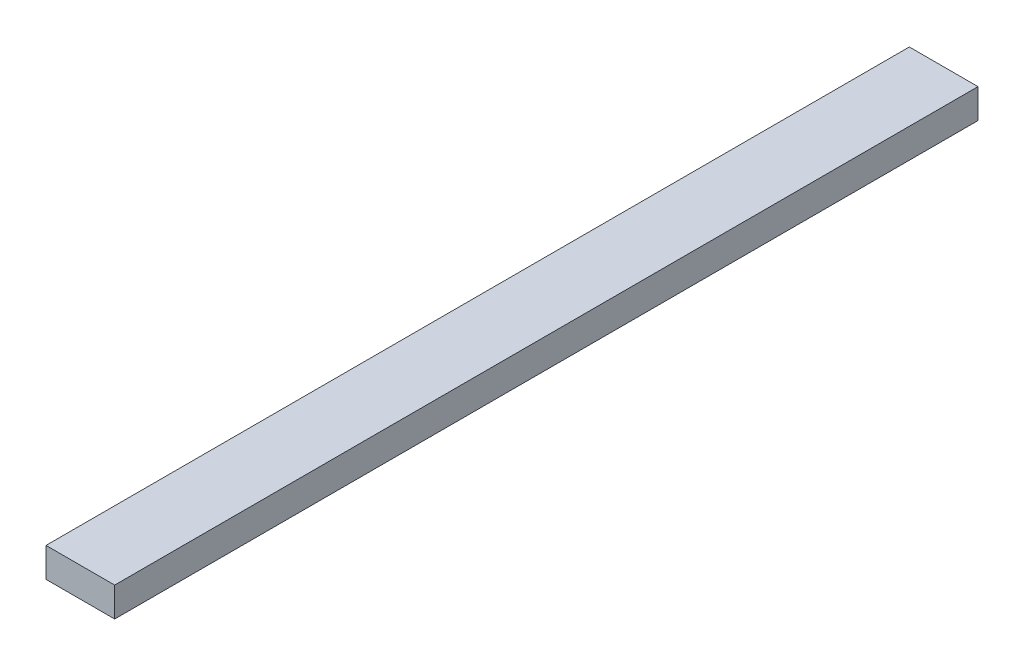
ISO-10303-21;
HEADER;
FILE_DESCRIPTION(('STEP AP214'),'2;1');
FILE_NAME('part.step','',(''),(''),'','','');
FILE_SCHEMA(('AUTOMOTIVE_DESIGN { 1 0 10303 214 1 1 1 1 }'));
ENDSEC;
DATA;
#1=APPLICATION_CONTEXT('core data for automotive mechanical design processes');
#2=APPLICATION_PROTOCOL_DEFINITION('international standard','automotive_design',2000,#1);
#3=PRODUCT_CONTEXT('',#1,'mechanical');
#4=PRODUCT('Part','Part','',(#3));
#5=PRODUCT_RELATED_PRODUCT_CATEGORY('part','',(#4));
#6=PRODUCT_DEFINITION_FORMATION('','',#4);
#7=PRODUCT_DEFINITION_CONTEXT('part definition',#1,'design');
#8=PRODUCT_DEFINITION('design','',#6,#7);
#9=PRODUCT_DEFINITION_SHAPE('','',#8);
#10=(LENGTH_UNIT() NAMED_UNIT(*) SI_UNIT(.MILLI.,.METRE.));
#11=(NAMED_UNIT(*) PLANE_ANGLE_UNIT() SI_UNIT($,.RADIAN.));
#12=(NAMED_UNIT(*) SI_UNIT($,.STERADIAN.) SOLID_ANGLE_UNIT());
#13=UNCERTAINTY_MEASURE_WITH_UNIT(LENGTH_MEASURE(1.E-05),#10,'distance_accuracy_value','');
#14=(GEOMETRIC_REPRESENTATION_CONTEXT(3) GLOBAL_UNCERTAINTY_ASSIGNED_CONTEXT((#13)) GLOBAL_UNIT_ASSIGNED_CONTEXT((#10,
#11,#12)) REPRESENTATION_CONTEXT('',''));
#15=CARTESIAN_POINT('',(0.,0.,0.));
#16=DIRECTION('',(0.,0.,1.));
#17=DIRECTION('',(1.,0.,0.));
#18=AXIS2_PLACEMENT_3D('',#15,#16,#17);
#19=CARTESIAN_POINT('',(0.,0.,1117.6));
#20=DIRECTION('',(1.,0.,0.));
#21=DIRECTION('',(0.,0.,-1.));
#22=AXIS2_PLACEMENT_3D('',#19,#20,#21);
#23=PLANE('',#22);
#24=DIRECTION('',(0.,-1.,0.));
#25=VECTOR('',#24,1.);
#26=CARTESIAN_POINT('',(0.,0.,0.));
#27=LINE('',#26,#25);
#28=CARTESIAN_POINT('',(0.,38.1,0.));
#29=VERTEX_POINT('',#28);
#30=CARTESIAN_POINT('',(0.,0.,0.));
#31=VERTEX_POINT('',#30);
#32=EDGE_CURVE('E96',#29,#31,#27,.T.);
#33=ORIENTED_EDGE('',*,*,#32,.T.);
#34=DIRECTION('',(0.,0.,-1.));
#35=VECTOR('',#34,1.);
#36=CARTESIAN_POINT('',(0.,0.,1117.6));
#37=LINE('',#36,#35);
#38=CARTESIAN_POINT('',(0.,0.,1117.6));
#39=VERTEX_POINT('',#38);
#40=EDGE_CURVE('E11',#39,#31,#37,.T.);
#41=ORIENTED_EDGE('',*,*,#40,.F.);
#42=DIRECTION('',(0.,-1.,0.));
#43=VECTOR('',#42,1.);
#44=CARTESIAN_POINT('',(0.,0.,1117.6));
#45=LINE('',#44,#43);
#46=CARTESIAN_POINT('',(0.,38.1,1117.6));
#47=VERTEX_POINT('',#46);
#48=EDGE_CURVE('E84',#47,#39,#45,.T.);
#49=ORIENTED_EDGE('',*,*,#48,.F.);
#50=DIRECTION('',(0.,0.,-1.));
#51=VECTOR('',#50,1.);
#52=CARTESIAN_POINT('',(0.,38.1,1117.6));
#53=LINE('',#52,#51);
#54=EDGE_CURVE('E92',#47,#29,#53,.T.);
#55=ORIENTED_EDGE('',*,*,#54,.T.);
#56=EDGE_LOOP('',(#33,#41,#49,#55));
#57=FACE_BOUND('',#56,.T.);
#58=ADVANCED_FACE('F33',(#57),#23,.F.);
#59=CARTESIAN_POINT('',(0.,0.,1117.6));
#60=DIRECTION('',(0.,1.,0.));
#61=DIRECTION('',(0.,0.,1.));
#62=AXIS2_PLACEMENT_3D('',#59,#60,#61);
#63=PLANE('',#62);
#64=DIRECTION('',(1.,0.,0.));
#65=VECTOR('',#64,1.);
#66=CARTESIAN_POINT('',(0.,0.,0.));
#67=LINE('',#66,#65);
#68=CARTESIAN_POINT('',(88.9,0.,0.));
#69=VERTEX_POINT('',#68);
#70=EDGE_CURVE('E88',#31,#69,#67,.T.);
#71=ORIENTED_EDGE('',*,*,#70,.T.);
#72=DIRECTION('',(0.,0.,-1.));
#73=VECTOR('',#72,1.);
#74=CARTESIAN_POINT('',(88.9,0.,1117.6));
#75=LINE('',#74,#73);
#76=CARTESIAN_POINT('',(88.9,0.,1117.6));
#77=VERTEX_POINT('',#76);
#78=EDGE_CURVE('E41',#77,#69,#75,.T.);
#79=ORIENTED_EDGE('',*,*,#78,.F.);
#80=DIRECTION('',(1.,0.,0.));
#81=VECTOR('',#80,1.);
#82=CARTESIAN_POINT('',(0.,0.,1117.6));
#83=LINE('',#82,#81);
#84=EDGE_CURVE('E79',#39,#77,#83,.T.);
#85=ORIENTED_EDGE('',*,*,#84,.F.);
#86=ORIENTED_EDGE('',*,*,#40,.T.);
#87=EDGE_LOOP('',(#71,#79,#85,#86));
#88=FACE_BOUND('',#87,.T.);
#89=ADVANCED_FACE('F87',(#88),#63,.F.);
#90=CARTESIAN_POINT('',(88.9,0.,1117.6));
#91=DIRECTION('',(-1.,0.,0.));
#92=DIRECTION('',(0.,0.,1.));
#93=AXIS2_PLACEMENT_3D('',#90,#91,#92);
#94=PLANE('',#93);
#95=DIRECTION('',(0.,1.,0.));
#96=VECTOR('',#95,1.);
#97=CARTESIAN_POINT('',(88.9,0.,0.));
#98=LINE('',#97,#96);
#99=CARTESIAN_POINT('',(88.9,38.1,0.));
#100=VERTEX_POINT('',#99);
#101=EDGE_CURVE('E66',#69,#100,#98,.T.);
#102=ORIENTED_EDGE('',*,*,#101,.T.);
#103=DIRECTION('',(0.,0.,-1.));
#104=VECTOR('',#103,1.);
#105=CARTESIAN_POINT('',(88.9,38.1,1117.6));
#106=LINE('',#105,#104);
#107=CARTESIAN_POINT('',(88.9,38.1,1117.6));
#108=VERTEX_POINT('',#107);
#109=EDGE_CURVE('E89',#108,#100,#106,.T.);
#110=ORIENTED_EDGE('',*,*,#109,.F.);
#111=DIRECTION('',(0.,1.,0.));
#112=VECTOR('',#111,1.);
#113=CARTESIAN_POINT('',(88.9,0.,1117.6));
#114=LINE('',#113,#112);
#115=EDGE_CURVE('E82',#77,#108,#114,.T.);
#116=ORIENTED_EDGE('',*,*,#115,.F.);
#117=ORIENTED_EDGE('',*,*,#78,.T.);
#118=EDGE_LOOP('',(#102,#110,#116,#117));
#119=FACE_BOUND('',#118,.T.);
#120=ADVANCED_FACE('F90',(#119),#94,.F.);
#121=CARTESIAN_POINT('',(0.,38.1,1117.6));
#122=DIRECTION('',(0.,-1.,0.));
#123=DIRECTION('',(0.,0.,-1.));
#124=AXIS2_PLACEMENT_3D('',#121,#122,#123);
#125=PLANE('',#124);
#126=DIRECTION('',(-1.,0.,0.));
#127=VECTOR('',#126,1.);
#128=CARTESIAN_POINT('',(0.,38.1,0.));
#129=LINE('',#128,#127);
#130=EDGE_CURVE('E72',#100,#29,#129,.T.);
#131=ORIENTED_EDGE('',*,*,#130,.T.);
#132=ORIENTED_EDGE('',*,*,#54,.F.);
#133=DIRECTION('',(-1.,0.,0.));
#134=VECTOR('',#133,1.);
#135=CARTESIAN_POINT('',(0.,38.1,1117.6));
#136=LINE('',#135,#134);
#137=EDGE_CURVE('E49',#108,#47,#136,.T.);
#138=ORIENTED_EDGE('',*,*,#137,.F.);
#139=ORIENTED_EDGE('',*,*,#109,.T.);
#140=EDGE_LOOP('',(#131,#132,#138,#139));
#141=FACE_BOUND('',#140,.T.);
#142=ADVANCED_FACE('F103',(#141),#125,.F.);
#143=CARTESIAN_POINT('',(0.,0.,1117.6));
#144=DIRECTION('',(0.,0.,-1.));
#145=DIRECTION('',(-1.,0.,0.));
#146=AXIS2_PLACEMENT_3D('',#143,#144,#145);
#147=PLANE('',#146);
#148=ORIENTED_EDGE('',*,*,#48,.T.);
#149=ORIENTED_EDGE('',*,*,#84,.T.);
#150=ORIENTED_EDGE('',*,*,#115,.T.);
#151=ORIENTED_EDGE('',*,*,#137,.T.);
#152=EDGE_LOOP('',(#148,#149,#150,#151));
#153=FACE_BOUND('',#152,.T.);
#154=ADVANCED_FACE('F80',(#153),#147,.F.);
#155=CARTESIAN_POINT('',(0.,0.,0.));
#156=DIRECTION('',(0.,0.,-1.));
#157=DIRECTION('',(-1.,0.,0.));
#158=AXIS2_PLACEMENT_3D('',#155,#156,#157);
#159=PLANE('',#158);
#160=ORIENTED_EDGE('',*,*,#32,.F.);
#161=ORIENTED_EDGE('',*,*,#130,.F.);
#162=ORIENTED_EDGE('',*,*,#101,.F.);
#163=ORIENTED_EDGE('',*,*,#70,.F.);
#164=EDGE_LOOP('',(#160,#161,#162,#163));
#165=FACE_BOUND('',#164,.T.);
#166=ADVANCED_FACE('F106',(#165),#159,.T.);
#167=CLOSED_SHELL('',(#58,#89,#120,#142,#154,#166));
#168=MANIFOLD_SOLID_BREP('B2',#167);
#169=ADVANCED_BREP_SHAPE_REPRESENTATION('',(#18,#168),#14);
#170=SHAPE_DEFINITION_REPRESENTATION(#9,#169);
ENDSEC;
END-ISO-10303-21;
